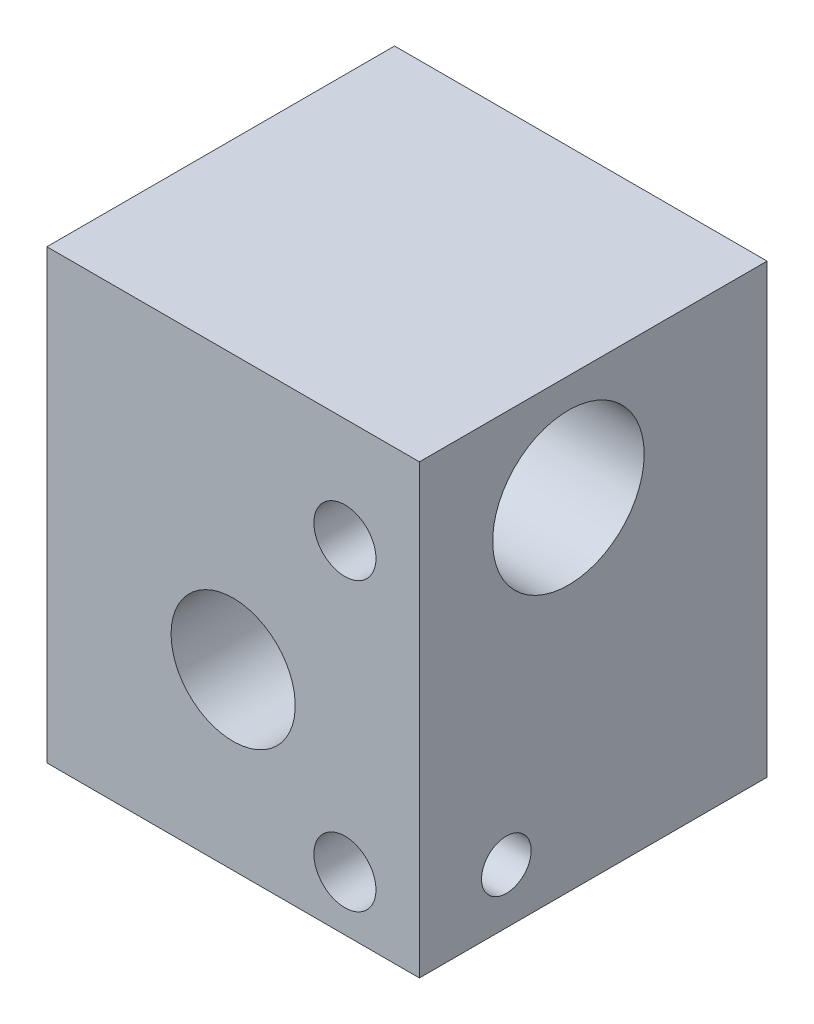
ISO-10303-21;
HEADER;
FILE_DESCRIPTION(('STEP AP214'),'2;1');
FILE_NAME('part.step','',(''),(''),'','','');
FILE_SCHEMA(('AUTOMOTIVE_DESIGN { 1 0 10303 214 1 1 1 1 }'));
ENDSEC;
DATA;
#1=APPLICATION_CONTEXT('core data for automotive mechanical design processes');
#2=APPLICATION_PROTOCOL_DEFINITION('international standard','automotive_design',2000,#1);
#3=PRODUCT_CONTEXT('',#1,'mechanical');
#4=PRODUCT('Part','Part','',(#3));
#5=PRODUCT_RELATED_PRODUCT_CATEGORY('part','',(#4));
#6=PRODUCT_DEFINITION_FORMATION('','',#4);
#7=PRODUCT_DEFINITION_CONTEXT('part definition',#1,'design');
#8=PRODUCT_DEFINITION('design','',#6,#7);
#9=PRODUCT_DEFINITION_SHAPE('','',#8);
#10=(LENGTH_UNIT() NAMED_UNIT(*) SI_UNIT(.MILLI.,.METRE.));
#11=(NAMED_UNIT(*) PLANE_ANGLE_UNIT() SI_UNIT($,.RADIAN.));
#12=(NAMED_UNIT(*) SI_UNIT($,.STERADIAN.) SOLID_ANGLE_UNIT());
#13=UNCERTAINTY_MEASURE_WITH_UNIT(LENGTH_MEASURE(1.E-05),#10,'distance_accuracy_value','');
#14=(GEOMETRIC_REPRESENTATION_CONTEXT(3) GLOBAL_UNCERTAINTY_ASSIGNED_CONTEXT((#13)) GLOBAL_UNIT_ASSIGNED_CONTEXT((#10,
#11,#12)) REPRESENTATION_CONTEXT('',''));
#15=CARTESIAN_POINT('',(0.,0.,0.));
#16=DIRECTION('',(0.,0.,1.));
#17=DIRECTION('',(1.,0.,0.));
#18=AXIS2_PLACEMENT_3D('',#15,#16,#17);
#19=CARTESIAN_POINT('',(7.5,-9.,14.));
#20=DIRECTION('',(-1.,0.,0.));
#21=DIRECTION('',(0.,0.,1.));
#22=AXIS2_PLACEMENT_3D('',#19,#20,#21);
#23=PLANE('',#22);
#24=CARTESIAN_POINT('',(7.5,-6.8,10.5));
#25=DIRECTION('',(1.,0.,0.));
#26=DIRECTION('',(0.,0.,-1.));
#27=AXIS2_PLACEMENT_3D('',#24,#25,#26);
#28=CIRCLE('',#27,0.999999999999998);
#29=CARTESIAN_POINT('',(7.5,-6.8,9.50000000000001));
#30=VERTEX_POINT('',#29);
#31=EDGE_CURVE('E109',#30,#30,#28,.T.);
#32=ORIENTED_EDGE('',*,*,#31,.F.);
#33=EDGE_LOOP('',(#32));
#34=FACE_BOUND('',#33,.T.);
#35=CARTESIAN_POINT('',(7.5,4.75,8.));
#36=DIRECTION('',(1.,0.,0.));
#37=DIRECTION('',(0.,0.,-1.));
#38=AXIS2_PLACEMENT_3D('',#35,#36,#37);
#39=CIRCLE('',#38,3.05);
#40=CARTESIAN_POINT('',(7.5,4.75,4.95));
#41=VERTEX_POINT('',#40);
#42=EDGE_CURVE('E234',#41,#41,#39,.T.);
#43=ORIENTED_EDGE('',*,*,#42,.F.);
#44=EDGE_LOOP('',(#43));
#45=FACE_BOUND('',#44,.T.);
#46=DIRECTION('',(0.,1.,0.));
#47=VECTOR('',#46,1.);
#48=CARTESIAN_POINT('',(7.5,-9.,0.));
#49=LINE('',#48,#47);
#50=CARTESIAN_POINT('',(7.5,-9.,0.));
#51=VERTEX_POINT('',#50);
#52=CARTESIAN_POINT('',(7.5,9.,0.));
#53=VERTEX_POINT('',#52);
#54=EDGE_CURVE('E195',#51,#53,#49,.T.);
#55=ORIENTED_EDGE('',*,*,#54,.T.);
#56=DIRECTION('',(0.,0.,-1.));
#57=VECTOR('',#56,1.);
#58=CARTESIAN_POINT('',(7.5,9.,14.));
#59=LINE('',#58,#57);
#60=CARTESIAN_POINT('',(7.5,9.,14.));
#61=VERTEX_POINT('',#60);
#62=EDGE_CURVE('E140',#61,#53,#59,.T.);
#63=ORIENTED_EDGE('',*,*,#62,.F.);
#64=DIRECTION('',(0.,1.,0.));
#65=VECTOR('',#64,1.);
#66=CARTESIAN_POINT('',(7.5,-9.,14.));
#67=LINE('',#66,#65);
#68=CARTESIAN_POINT('',(7.5,-9.,14.));
#69=VERTEX_POINT('',#68);
#70=EDGE_CURVE('E206',#69,#61,#67,.T.);
#71=ORIENTED_EDGE('',*,*,#70,.F.);
#72=DIRECTION('',(0.,0.,-1.));
#73=VECTOR('',#72,1.);
#74=CARTESIAN_POINT('',(7.5,-9.,14.));
#75=LINE('',#74,#73);
#76=EDGE_CURVE('E210',#69,#51,#75,.T.);
#77=ORIENTED_EDGE('',*,*,#76,.T.);
#78=EDGE_LOOP('',(#55,#63,#71,#77));
#79=FACE_BOUND('',#78,.T.);
#80=ADVANCED_FACE('F38',(#34,#45,#79),#23,.F.);
#81=CARTESIAN_POINT('',(-7.5,9.,14.));
#82=DIRECTION('',(0.,-1.,0.));
#83=DIRECTION('',(0.,0.,-1.));
#84=AXIS2_PLACEMENT_3D('',#81,#82,#83);
#85=PLANE('',#84);
#86=DIRECTION('',(-1.,0.,0.));
#87=VECTOR('',#86,1.);
#88=CARTESIAN_POINT('',(-7.5,9.,0.));
#89=LINE('',#88,#87);
#90=CARTESIAN_POINT('',(-7.5,9.,0.));
#91=VERTEX_POINT('',#90);
#92=EDGE_CURVE('E185',#53,#91,#89,.T.);
#93=ORIENTED_EDGE('',*,*,#92,.T.);
#94=DIRECTION('',(0.,0.,-1.));
#95=VECTOR('',#94,1.);
#96=CARTESIAN_POINT('',(-7.5,9.,14.));
#97=LINE('',#96,#95);
#98=CARTESIAN_POINT('',(-7.5,9.,14.));
#99=VERTEX_POINT('',#98);
#100=EDGE_CURVE('E187',#99,#91,#97,.T.);
#101=ORIENTED_EDGE('',*,*,#100,.F.);
#102=DIRECTION('',(-1.,0.,0.));
#103=VECTOR('',#102,1.);
#104=CARTESIAN_POINT('',(-7.5,9.,14.));
#105=LINE('',#104,#103);
#106=EDGE_CURVE('E220',#61,#99,#105,.T.);
#107=ORIENTED_EDGE('',*,*,#106,.F.);
#108=ORIENTED_EDGE('',*,*,#62,.T.);
#109=EDGE_LOOP('',(#93,#101,#107,#108));
#110=FACE_BOUND('',#109,.T.);
#111=ADVANCED_FACE('F175',(#110),#85,.F.);
#112=CARTESIAN_POINT('',(-7.5,-9.,14.));
#113=DIRECTION('',(1.,0.,0.));
#114=DIRECTION('',(0.,0.,-1.));
#115=AXIS2_PLACEMENT_3D('',#112,#113,#114);
#116=PLANE('',#115);
#117=CARTESIAN_POINT('',(-7.5,4.75,8.));
#118=DIRECTION('',(1.,0.,0.));
#119=DIRECTION('',(0.,0.,-1.));
#120=AXIS2_PLACEMENT_3D('',#117,#118,#119);
#121=CIRCLE('',#120,3.05);
#122=CARTESIAN_POINT('',(-7.5,4.75,4.95));
#123=VERTEX_POINT('',#122);
#124=EDGE_CURVE('E231',#123,#123,#121,.T.);
#125=ORIENTED_EDGE('',*,*,#124,.T.);
#126=EDGE_LOOP('',(#125));
#127=FACE_BOUND('',#126,.T.);
#128=DIRECTION('',(0.,-1.,0.));
#129=VECTOR('',#128,1.);
#130=CARTESIAN_POINT('',(-7.5,-9.,0.));
#131=LINE('',#130,#129);
#132=CARTESIAN_POINT('',(-7.5,-9.,0.));
#133=VERTEX_POINT('',#132);
#134=EDGE_CURVE('E194',#91,#133,#131,.T.);
#135=ORIENTED_EDGE('',*,*,#134,.T.);
#136=DIRECTION('',(0.,0.,-1.));
#137=VECTOR('',#136,1.);
#138=CARTESIAN_POINT('',(-7.5,-9.,14.));
#139=LINE('',#138,#137);
#140=CARTESIAN_POINT('',(-7.5,-9.,14.));
#141=VERTEX_POINT('',#140);
#142=EDGE_CURVE('E201',#141,#133,#139,.T.);
#143=ORIENTED_EDGE('',*,*,#142,.F.);
#144=DIRECTION('',(0.,-1.,0.));
#145=VECTOR('',#144,1.);
#146=CARTESIAN_POINT('',(-7.5,-9.,14.));
#147=LINE('',#146,#145);
#148=EDGE_CURVE('E200',#99,#141,#147,.T.);
#149=ORIENTED_EDGE('',*,*,#148,.F.);
#150=ORIENTED_EDGE('',*,*,#100,.T.);
#151=EDGE_LOOP('',(#135,#143,#149,#150));
#152=FACE_BOUND('',#151,.T.);
#153=ADVANCED_FACE('F172',(#127,#152),#116,.F.);
#154=CARTESIAN_POINT('',(-7.5,-9.,14.));
#155=DIRECTION('',(0.,1.,0.));
#156=DIRECTION('',(0.,0.,1.));
#157=AXIS2_PLACEMENT_3D('',#154,#155,#156);
#158=PLANE('',#157);
#159=DIRECTION('',(1.,0.,0.));
#160=VECTOR('',#159,1.);
#161=CARTESIAN_POINT('',(-7.5,-9.,0.));
#162=LINE('',#161,#160);
#163=EDGE_CURVE('E204',#133,#51,#162,.T.);
#164=ORIENTED_EDGE('',*,*,#163,.T.);
#165=ORIENTED_EDGE('',*,*,#76,.F.);
#166=DIRECTION('',(1.,0.,0.));
#167=VECTOR('',#166,1.);
#168=CARTESIAN_POINT('',(-7.5,-9.,14.));
#169=LINE('',#168,#167);
#170=EDGE_CURVE('E213',#141,#69,#169,.T.);
#171=ORIENTED_EDGE('',*,*,#170,.F.);
#172=ORIENTED_EDGE('',*,*,#142,.T.);
#173=EDGE_LOOP('',(#164,#165,#171,#172));
#174=FACE_BOUND('',#173,.T.);
#175=ADVANCED_FACE('F165',(#174),#158,.F.);
#176=CARTESIAN_POINT('',(0.,0.,14.));
#177=DIRECTION('',(0.,0.,-1.));
#178=DIRECTION('',(-1.,0.,0.));
#179=AXIS2_PLACEMENT_3D('',#176,#177,#178);
#180=PLANE('',#179);
#181=CARTESIAN_POINT('',(4.5,4.75,14.));
#182=DIRECTION('',(0.,0.,1.));
#183=DIRECTION('',(1.,0.,0.));
#184=AXIS2_PLACEMENT_3D('',#181,#182,#183);
#185=CIRCLE('',#184,1.24999999999999);
#186=CARTESIAN_POINT('',(5.74999999999999,4.75,14.));
#187=VERTEX_POINT('',#186);
#188=EDGE_CURVE('E246',#187,#187,#185,.T.);
#189=ORIENTED_EDGE('',*,*,#188,.F.);
#190=EDGE_LOOP('',(#189));
#191=FACE_BOUND('',#190,.T.);
#192=CARTESIAN_POINT('',(4.5,-6.8,14.));
#193=DIRECTION('',(0.,0.,1.));
#194=DIRECTION('',(1.,0.,0.));
#195=AXIS2_PLACEMENT_3D('',#192,#193,#194);
#196=CIRCLE('',#195,1.24999999999999);
#197=CARTESIAN_POINT('',(5.74999999999999,-6.8,14.));
#198=VERTEX_POINT('',#197);
#199=EDGE_CURVE('E244',#198,#198,#196,.T.);
#200=ORIENTED_EDGE('',*,*,#199,.F.);
#201=EDGE_LOOP('',(#200));
#202=FACE_BOUND('',#201,.T.);
#203=CARTESIAN_POINT('',(0.,-2.,14.));
#204=DIRECTION('',(0.,0.,-1.));
#205=DIRECTION('',(-1.,0.,0.));
#206=AXIS2_PLACEMENT_3D('',#203,#204,#205);
#207=CIRCLE('',#206,2.5);
#208=CARTESIAN_POINT('',(-2.5,-2.,14.));
#209=VERTEX_POINT('',#208);
#210=EDGE_CURVE('E223',#209,#209,#207,.T.);
#211=ORIENTED_EDGE('',*,*,#210,.T.);
#212=EDGE_LOOP('',(#211));
#213=FACE_BOUND('',#212,.T.);
#214=ORIENTED_EDGE('',*,*,#70,.T.);
#215=ORIENTED_EDGE('',*,*,#106,.T.);
#216=ORIENTED_EDGE('',*,*,#148,.T.);
#217=ORIENTED_EDGE('',*,*,#170,.T.);
#218=EDGE_LOOP('',(#214,#215,#216,#217));
#219=FACE_BOUND('',#218,.T.);
#220=ADVANCED_FACE('F162',(#191,#202,#213,#219),#180,.F.);
#221=CARTESIAN_POINT('',(0.,0.,0.));
#222=DIRECTION('',(0.,0.,-1.));
#223=DIRECTION('',(-1.,0.,0.));
#224=AXIS2_PLACEMENT_3D('',#221,#222,#223);
#225=PLANE('',#224);
#226=CARTESIAN_POINT('',(0.,-2.,0.));
#227=DIRECTION('',(0.,0.,-1.));
#228=DIRECTION('',(-1.,0.,0.));
#229=AXIS2_PLACEMENT_3D('',#226,#227,#228);
#230=CIRCLE('',#229,2.5);
#231=CARTESIAN_POINT('',(-2.5,-2.,0.));
#232=VERTEX_POINT('',#231);
#233=EDGE_CURVE('E226',#232,#232,#230,.T.);
#234=ORIENTED_EDGE('',*,*,#233,.F.);
#235=EDGE_LOOP('',(#234));
#236=FACE_BOUND('',#235,.T.);
#237=ORIENTED_EDGE('',*,*,#54,.F.);
#238=ORIENTED_EDGE('',*,*,#163,.F.);
#239=ORIENTED_EDGE('',*,*,#134,.F.);
#240=ORIENTED_EDGE('',*,*,#92,.F.);
#241=EDGE_LOOP('',(#237,#238,#239,#240));
#242=FACE_BOUND('',#241,.T.);
#243=ADVANCED_FACE('F160',(#236,#242),#225,.T.);
#244=CARTESIAN_POINT('',(0.,-2.,14.));
#245=DIRECTION('',(0.,0.,-1.));
#246=DIRECTION('',(-1.,0.,0.));
#247=AXIS2_PLACEMENT_3D('',#244,#245,#246);
#248=CYLINDRICAL_SURFACE('',#247,2.5);
#249=ORIENTED_EDGE('',*,*,#210,.F.);
#250=EDGE_LOOP('',(#249));
#251=FACE_BOUND('',#250,.T.);
#252=ORIENTED_EDGE('',*,*,#233,.T.);
#253=EDGE_LOOP('',(#252));
#254=FACE_BOUND('',#253,.T.);
#255=ADVANCED_FACE('F156',(#251,#254),#248,.F.);
#256=CARTESIAN_POINT('',(-7.5,4.75,8.));
#257=DIRECTION('',(1.,0.,0.));
#258=DIRECTION('',(0.,0.,-1.));
#259=AXIS2_PLACEMENT_3D('',#256,#257,#258);
#260=CYLINDRICAL_SURFACE('',#259,3.05);
#261=CARTESIAN_POINT('',(5.74999999999999,4.75,11.05));
#262=CARTESIAN_POINT('',(5.74999317358084,4.81705105449435,11.0499949013604));
#263=CARTESIAN_POINT('',(5.7445728904159,4.88421220939516,11.0477631660117));
#264=CARTESIAN_POINT('',(5.7230821427269,5.01663531512961,11.0390522074982));
#265=CARTESIAN_POINT('',(5.7069833965083,5.08189174087961,11.0325617055695));
#266=CARTESIAN_POINT('',(5.66482596800735,5.20837429284752,11.0160314903456));
#267=CARTESIAN_POINT('',(5.63880056530878,5.2696130929358,11.0060036445159));
#268=CARTESIAN_POINT('',(5.57766372514542,5.38679775394015,10.9833797920162));
#269=CARTESIAN_POINT('',(5.54255520538643,5.44274530666015,10.9707846103085));
#270=CARTESIAN_POINT('',(5.46243359833868,5.55058268229026,10.9436027218373));
#271=CARTESIAN_POINT('',(5.41704813784625,5.60217961883631,10.9289521872081));
#272=CARTESIAN_POINT('',(5.31844769395315,5.69727980579278,10.8995935820288));
#273=CARTESIAN_POINT('',(5.26522873562099,5.74077892161812,10.8848854859807));
#274=CARTESIAN_POINT('',(5.1494220879687,5.82047635819198,10.85630174305));
#275=CARTESIAN_POINT('',(5.08651058665788,5.85623272255294,10.8424982426337));
#276=CARTESIAN_POINT('',(4.95491722684178,5.91652509902148,10.8182942706523));
#277=CARTESIAN_POINT('',(4.88623826542879,5.9410667050528,10.8078921032399));
#278=CARTESIAN_POINT('',(4.74842884283273,5.977033698322,10.7923570793826));
#279=CARTESIAN_POINT('',(4.67947149284317,5.98902161527503,10.7869994326088));
#280=CARTESIAN_POINT('',(4.54033187566907,6.00129693566521,10.7815114553913));
#281=CARTESIAN_POINT('',(4.47015027248521,6.00159049579919,10.7813783743849));
#282=CARTESIAN_POINT('',(4.33607409840986,5.99089353762405,10.7861636899656));
#283=CARTESIAN_POINT('',(4.27209740726591,5.98073314256808,10.7907104791605));
#284=CARTESIAN_POINT('',(4.14685271703793,5.95080567936669,10.8037170132426));
#285=CARTESIAN_POINT('',(4.08558521945647,5.93103684064336,10.8121774793014));
#286=CARTESIAN_POINT('',(3.96597856734735,5.88207159424284,10.8322471574019));
#287=CARTESIAN_POINT('',(3.90772757534972,5.85268647565431,10.8439185833376));
#288=CARTESIAN_POINT('',(3.79676189319712,5.78545581744839,10.8690795378448));
#289=CARTESIAN_POINT('',(3.74404935655718,5.7476070046597,10.8825697690007));
#290=CARTESIAN_POINT('',(3.64113506271575,5.66089979031177,10.9111866936785));
#291=CARTESIAN_POINT('',(3.59148817119212,5.61139546177047,10.9263571479584));
#292=CARTESIAN_POINT('',(3.50101833818234,5.50460843164101,10.9556944852389));
#293=CARTESIAN_POINT('',(3.46019733238115,5.44732402821036,10.9698611476317));
#294=CARTESIAN_POINT('',(3.38776019476994,5.32496342854657,10.9959821432301));
#295=CARTESIAN_POINT('',(3.35636271935724,5.25974527572702,11.0078818781997));
#296=CARTESIAN_POINT('',(3.30517803112997,5.12434088842293,11.0277118513072));
#297=CARTESIAN_POINT('',(3.28538461664024,5.05415733016857,11.0356442094366));
#298=CARTESIAN_POINT('',(3.25911499785756,4.91545720041041,11.0462536382505));
#299=CARTESIAN_POINT('',(3.25189372784432,4.84710415103708,11.0492242691095));
#300=CARTESIAN_POINT('',(3.24876092149755,4.71010441371817,11.0505074612745));
#301=CARTESIAN_POINT('',(3.25284627086616,4.64145781182913,11.0488213052473));
#302=CARTESIAN_POINT('',(3.27167121733155,4.50926209998629,11.0411715650926));
#303=CARTESIAN_POINT('',(3.28589367478943,4.44562598291882,11.0354157047658));
#304=CARTESIAN_POINT('',(3.32387605471634,4.32170816248345,11.0204245132917));
#305=CARTESIAN_POINT('',(3.34763719121059,4.26142688721188,11.0111887392511));
#306=CARTESIAN_POINT('',(3.40479928404273,4.14383011012163,10.9897729532255));
#307=CARTESIAN_POINT('',(3.43847544195124,4.08666382302296,10.9775107773215));
#308=CARTESIAN_POINT('',(3.51420811639302,3.97859041874229,10.9513596558571));
#309=CARTESIAN_POINT('',(3.55626807827196,3.92768588879936,10.9374700424678));
#310=CARTESIAN_POINT('',(3.65098440399942,3.82987991098666,10.9083776173988));
#311=CARTESIAN_POINT('',(3.70417275944046,3.78349954211682,10.8931504614281));
#312=CARTESIAN_POINT('',(3.81783195761042,3.70018452435906,10.8639729574469));
#313=CARTESIAN_POINT('',(3.87830425548019,3.66325176747518,10.8500228655432));
#314=CARTESIAN_POINT('',(4.00591935720062,3.59955272757804,10.8249182430305));
#315=CARTESIAN_POINT('',(4.0731350035576,3.57291696039833,10.8138001745101));
#316=CARTESIAN_POINT('',(4.21169404128461,3.53156002386075,10.7961436278396));
#317=CARTESIAN_POINT('',(4.28303413036749,3.51682946022231,10.7896015393776));
#318=CARTESIAN_POINT('',(4.42205571719578,3.50061997017984,10.7823768658224));
#319=CARTESIAN_POINT('',(4.48961071540186,3.49823064874135,10.7812918903951));
#320=CARTESIAN_POINT('',(4.62411541510115,3.50435741732201,10.784041310068));
#321=CARTESIAN_POINT('',(4.69106520115461,3.51287195937366,10.7878750068888));
#322=CARTESIAN_POINT('',(4.8194595845332,3.53980857539514,10.7996672497341));
#323=CARTESIAN_POINT('',(4.88101694579431,3.55778270632242,10.8074387530386));
#324=CARTESIAN_POINT('',(5.00026093044538,3.60269826055876,10.8260903977768));
#325=CARTESIAN_POINT('',(5.0579464682445,3.62964218632339,10.8369714066019));
#326=CARTESIAN_POINT('',(5.17152052867124,3.69356546820026,10.8614124432364));
#327=CARTESIAN_POINT('',(5.22710231558399,3.73104304994741,10.8750926415299));
#328=CARTESIAN_POINT('',(5.33147333634056,3.81425954659736,10.9032425910236));
#329=CARTESIAN_POINT('',(5.38026033074679,3.8600011738197,10.9177126003541));
#330=CARTESIAN_POINT('',(5.47314082024466,3.96222488066987,10.9470198528145));
#331=CARTESIAN_POINT('',(5.51667265144533,4.0192324065468,10.961812751821));
#332=CARTESIAN_POINT('',(5.59357367951555,4.14029737005191,10.9890812629905));
#333=CARTESIAN_POINT('',(5.6269382146159,4.20435802331352,11.0015558111556));
#334=CARTESIAN_POINT('',(5.68180811191665,4.33663629870453,11.0225880646031));
#335=CARTESIAN_POINT('',(5.70351052450805,4.40476171520484,11.0312104073118));
#336=CARTESIAN_POINT('',(5.73495872650017,4.54399616753341,11.0438313485993));
#337=CARTESIAN_POINT('',(5.74474216568277,4.61509507070934,11.0478445044153));
#338=CARTESIAN_POINT('',(5.74946289651355,4.70760124338892,11.0497805301545));
#339=CARTESIAN_POINT('',(5.75000215885384,4.72879511590617,11.0500016124439));
#340=CARTESIAN_POINT('',(5.74999999999999,4.75,11.05));
#341=B_SPLINE_CURVE_WITH_KNOTS('',3,(#261,#262,#263,#264,#265,#266,#267,#268,#269,#270,#271,
#272,#273,#274,#275,#276,#277,#278,#279,#280,#281,#282,#283,#284,#285,#286,#287,#288,#289,#290,
#291,#292,#293,#294,#295,#296,#297,#298,#299,#300,#301,#302,#303,#304,#305,#306,#307,#308,#309,
#310,#311,#312,#313,#314,#315,#316,#317,#318,#319,#320,#321,#322,#323,#324,#325,#326,#327,#328,
#329,#330,#331,#332,#333,#334,#335,#336,#337,#338,#339,#340),.UNSPECIFIED.,.T.,.F.,(4,2,2,2,2,2,
2,2,2,2,2,2,2,2,2,2,2,2,2,2,2,2,2,2,2,2,2,2,2,2,2,2,2,2,2,2,2,2,2,4),(0.,0.201094311180327,
0.402723354574274,0.60368228554281,0.804576743863708,1.01444492091329,1.22441996030868,
1.44431409976959,1.66409843594336,1.87354721803841,2.08288573073389,2.27679448285735,
2.47073898070664,2.66874390795883,2.86682554265503,3.08105274490332,3.29532688370776,
3.51424468844056,3.73304538781654,3.93837132545348,4.14364071369572,4.33912550528581,
4.53463518488672,4.7361865564197,4.93782092740471,5.15341391236424,5.36905003881043,
5.58733616568886,5.80544987646513,6.00721727204662,6.20895602688514,6.40190297186301,
6.59490379169176,6.79928960640031,7.00374262427849,7.22240178249367,7.44116104698124,
7.65609749208749,7.87035321839583,7.93394925864703),.UNSPECIFIED.);
#342=CARTESIAN_POINT('',(5.74999999999999,4.75,11.05));
#343=VERTEX_POINT('',#342);
#344=EDGE_CURVE('E141',#343,#343,#341,.T.);
#345=ORIENTED_EDGE('',*,*,#344,.T.);
#346=EDGE_LOOP('',(#345));
#347=FACE_BOUND('',#346,.T.);
#348=ORIENTED_EDGE('',*,*,#124,.F.);
#349=EDGE_LOOP('',(#348));
#350=FACE_BOUND('',#349,.T.);
#351=ORIENTED_EDGE('',*,*,#42,.T.);
#352=EDGE_LOOP('',(#351));
#353=FACE_BOUND('',#352,.T.);
#354=ADVANCED_FACE('F150',(#347,#350,#353),#260,.F.);
#355=CARTESIAN_POINT('',(4.5,-6.8,10.));
#356=DIRECTION('',(0.,0.,1.));
#357=DIRECTION('',(1.,0.,0.));
#358=AXIS2_PLACEMENT_3D('',#355,#356,#357);
#359=CONICAL_SURFACE('',#358,1.25,1.02974425867665);
#360=CARTESIAN_POINT('',(4.5,-6.8,9.24892422621555));
#361=VERTEX_POINT('',#360);
#362=VERTEX_LOOP('',#361);
#363=FACE_BOUND('',#362,.T.);
#364=CARTESIAN_POINT('',(4.5,-6.8,10.));
#365=DIRECTION('',(0.,0.,1.));
#366=DIRECTION('',(1.,0.,0.));
#367=AXIS2_PLACEMENT_3D('',#364,#365,#366);
#368=CIRCLE('',#367,1.25);
#369=CARTESIAN_POINT('',(3.598612181134,-7.66602540378443,10.));
#370=VERTEX_POINT('',#369);
#371=CARTESIAN_POINT('',(5.40138781886869,-7.66602540378681,10.000000000002));
#372=VERTEX_POINT('',#371);
#373=EDGE_CURVE('E243',#370,#372,#368,.T.);
#374=ORIENTED_EDGE('',*,*,#373,.T.);
#375=CARTESIAN_POINT('',(5.49028641707355,-7.69312930754734,10.0502));
#376=CARTESIAN_POINT('',(5.4620540291597,-7.68516229364402,10.0343944640343));
#377=CARTESIAN_POINT('',(5.43397441822092,-7.67667040293627,10.0185644062554));
#378=CARTESIAN_POINT('',(5.37820933805071,-7.65846567832842,9.98679857880335));
#379=CARTESIAN_POINT('',(5.35052460000254,-7.64875084220867,9.97086267732073));
#380=CARTESIAN_POINT('',(5.29534164443274,-7.62780610981276,9.93865263805377));
#381=CARTESIAN_POINT('',(5.26785172041544,-7.6165565790724,9.92237691803523));
#382=CARTESIAN_POINT('',(5.21372068820973,-7.59240944996764,9.88967177107602));
#383=CARTESIAN_POINT('',(5.18707899740182,-7.5795130147024,9.87324246012329));
#384=CARTESIAN_POINT('',(5.13220243909833,-7.55021227801001,9.83836852135706));
#385=CARTESIAN_POINT('',(5.10410431543777,-7.53357989189848,9.8198971567474));
#386=CARTESIAN_POINT('',(5.050345171257,-7.49710879666876,9.78255861572175));
#387=CARTESIAN_POINT('',(5.02467984624535,-7.4772759250474,9.76369221334503));
#388=CARTESIAN_POINT('',(4.98483989175455,-7.43999201796968,9.73135380836442));
#389=CARTESIAN_POINT('',(4.96954941989287,-7.4236625107789,9.71799347162254));
#390=CARTESIAN_POINT('',(4.9421847888438,-7.38857975994309,9.6912618305678));
#391=CARTESIAN_POINT('',(4.93009685493829,-7.36983742938766,9.67789082979815));
#392=CARTESIAN_POINT('',(4.91016740799822,-7.329590146974,9.65140304199133));
#393=CARTESIAN_POINT('',(4.90238168548031,-7.3080531773224,9.63829162851512));
#394=CARTESIAN_POINT('',(4.89169708291768,-7.26309379111954,9.61331666161574));
#395=CARTESIAN_POINT('',(4.88881009238113,-7.23966693149489,9.60145620952708));
#396=CARTESIAN_POINT('',(4.88623771053257,-7.18102854252964,9.5746459349784));
#397=CARTESIAN_POINT('',(4.8886037228914,-7.14530002689939,9.56074189203022));
#398=CARTESIAN_POINT('',(4.89581292295022,-7.07266926803107,9.53712400838137));
#399=CARTESIAN_POINT('',(4.90066989969421,-7.035761575187,9.52743405299092));
#400=CARTESIAN_POINT('',(4.91006860539325,-6.95380542606474,9.51086100553405));
#401=CARTESIAN_POINT('',(4.91437678220478,-6.90853802728334,9.50485597158093));
#402=CARTESIAN_POINT('',(4.91847480674921,-6.81754799344687,9.49912238604378));
#403=CARTESIAN_POINT('',(4.91828328292789,-6.77182801826921,9.49936795774198));
#404=CARTESIAN_POINT('',(4.9134188134261,-6.67863261058293,9.50622854677725));
#405=CARTESIAN_POINT('',(4.90849830019974,-6.63120016203334,9.51319551359829));
#406=CARTESIAN_POINT('',(4.8974167784806,-6.53776947303588,9.53380349357298));
#407=CARTESIAN_POINT('',(4.89125185371858,-6.4917763035517,9.54746577626934));
#408=CARTESIAN_POINT('',(4.88715963497419,-6.42244524242513,9.57365031385066));
#409=CARTESIAN_POINT('',(4.88674774685179,-6.39841640858866,9.58380701297793));
#410=CARTESIAN_POINT('',(4.88976593975289,-6.35153496523309,9.60582909571334));
#411=CARTESIAN_POINT('',(4.89316735273017,-6.32867491195562,9.61768115280813));
#412=CARTESIAN_POINT('',(4.90481955461782,-6.28460383870021,9.642669092288));
#413=CARTESIAN_POINT('',(4.9131225726936,-6.26341340810177,9.65581751190305));
#414=CARTESIAN_POINT('',(4.93411194219539,-6.22351706477168,9.68253382279197));
#415=CARTESIAN_POINT('',(4.94682115498955,-6.20482482880032,9.69610355897556));
#416=CARTESIAN_POINT('',(4.98149614630583,-6.16232995685964,9.72903491275925));
#417=CARTESIAN_POINT('',(5.00508221426014,-6.13985006830771,9.74834355388398));
#418=CARTESIAN_POINT('',(5.0558137494365,-6.098684880619,9.78659230699454));
#419=CARTESIAN_POINT('',(5.08298397356536,-6.08002851866165,9.80552869364957));
#420=CARTESIAN_POINT('',(5.14072146790838,-6.0447977067922,9.84396632214519));
#421=CARTESIAN_POINT('',(5.17139042773862,-6.02837263772574,9.86344892060987));
#422=CARTESIAN_POINT('',(5.23412643971759,-5.99799989181846,9.90217002760718));
#423=CARTESIAN_POINT('',(5.26619554023356,-5.98405600718381,9.92140812147574));
#424=CARTESIAN_POINT('',(5.3300143351173,-5.95868810757523,9.95899211536545));
#425=CARTESIAN_POINT('',(5.36173093611331,-5.94718922450714,9.97734442596747));
#426=CARTESIAN_POINT('',(5.4256642289682,-5.92585951930255,10.0138744249624));
#427=CARTESIAN_POINT('',(5.45787881496915,-5.91602307251018,10.032052497566));
#428=CARTESIAN_POINT('',(5.49028641707356,-5.90687069245266,10.0502));
#429=B_SPLINE_CURVE_WITH_KNOTS('',3,(#375,#376,#377,#378,#379,#380,#381,#382,#383,#384,#385,
#386,#387,#388,#389,#390,#391,#392,#393,#394,#395,#396,#397,#398,#399,#400,#401,#402,#403,#404,
#405,#406,#407,#408,#409,#410,#411,#412,#413,#414,#415,#416,#417,#418,#419,#420,#421,#422,#423,
#424,#425,#426,#427,#428),.UNSPECIFIED.,.F.,.F.,(4,2,2,2,2,2,2,2,2,2,2,2,2,2,2,2,2,2,2,2,2,2,2,
2,2,2,4),(0.,0.0999728954722881,0.200111649914619,0.301678803220376,0.403174619034591,
0.515584481665859,0.627791585764162,0.705740491157831,0.783348470749535,0.861940559971277,
0.940723125374574,1.05531115599275,1.17054046158092,1.30757349647233,1.44403932453253,
1.58806182841254,1.73254485532535,1.81057795926005,1.88802832841069,1.96631925883886,
2.04502263303189,2.1580235273095,2.271850389424,2.39132944073084,2.51098956226302,
2.62616392516714,2.74094044998116),.UNSPECIFIED.);
#430=CARTESIAN_POINT('',(5.401387818866,-5.93397459621556,10.));
#431=VERTEX_POINT('',#430);
#432=EDGE_CURVE('E11',#372,#431,#429,.T.);
#433=ORIENTED_EDGE('',*,*,#432,.T.);
#434=CARTESIAN_POINT('',(3.59861218113131,-5.93397459621319,10.000000000002));
#435=VERTEX_POINT('',#434);
#436=EDGE_CURVE('E238',#431,#435,#368,.T.);
#437=ORIENTED_EDGE('',*,*,#436,.T.);
#438=CARTESIAN_POINT('',(3.50971358292644,-5.90687069245266,10.0502));
#439=CARTESIAN_POINT('',(3.53331315066843,-5.91352483721161,10.0369915361994));
#440=CARTESIAN_POINT('',(3.5567997123455,-5.92055093156863,10.0237650161817));
#441=CARTESIAN_POINT('',(3.60349741941001,-5.9354342598509,9.99724961432135));
#442=CARTESIAN_POINT('',(3.62670833949662,-5.943292127758,9.98396069239588));
#443=CARTESIAN_POINT('',(3.69717031261121,-5.96872321181212,9.94319816564678));
#444=CARTESIAN_POINT('',(3.7438358110887,-5.98776882275197,9.91561372999426));
#445=CARTESIAN_POINT('',(3.83471240297246,-6.03095640395233,9.85981688611285));
#446=CARTESIAN_POINT('',(3.87891676344681,-6.05511156272037,9.83160302516138));
#447=CARTESIAN_POINT('',(3.94083716089381,-6.09681482391589,9.78872178686289));
#448=CARTESIAN_POINT('',(3.96066329263914,-6.11154589536983,9.77440315102412));
#449=CARTESIAN_POINT('',(3.99813510882635,-6.14332035661841,9.74552415052808));
#450=CARTESIAN_POINT('',(4.01578567575378,-6.16035838166081,9.73096441352294));
#451=CARTESIAN_POINT('',(4.04652590778618,-6.19591099573206,9.70278607647913));
#452=CARTESIAN_POINT('',(4.05985910623184,-6.21421741426561,9.68917928098483));
#453=CARTESIAN_POINT('',(4.08226510274055,-6.2533626627292,9.66229859506211));
#454=CARTESIAN_POINT('',(4.09136422741643,-6.27418480156528,9.64902314678261));
#455=CARTESIAN_POINT('',(4.10464310673414,-6.31793974424823,9.62349687802884));
#456=CARTESIAN_POINT('',(4.10881781004169,-6.34087468940768,9.61124712162209));
#457=CARTESIAN_POINT('',(4.1130626560013,-6.38806657508964,9.58840380415463));
#458=CARTESIAN_POINT('',(4.11309881514464,-6.41233282411698,9.57782466777655));
#459=CARTESIAN_POINT('',(4.11081909538786,-6.4604609728452,9.55906713984957));
#460=CARTESIAN_POINT('',(4.10859993826291,-6.4842984232144,9.55080787372999));
#461=CARTESIAN_POINT('',(4.10335614543741,-6.53246306784324,9.5361231670742));
#462=CARTESIAN_POINT('',(4.1003306042383,-6.55679078406328,9.52969980500596));
#463=CARTESIAN_POINT('',(4.09451085196856,-6.60579562257215,9.51871894904033));
#464=CARTESIAN_POINT('',(4.09171580951763,-6.63047107603482,9.51415449234926));
#465=CARTESIAN_POINT('',(4.08702679450585,-6.68017771335,9.50688722680716));
#466=CARTESIAN_POINT('',(4.08513254220296,-6.70520878427464,9.50418383988055));
#467=CARTESIAN_POINT('',(4.08254750308201,-6.75738125016417,9.5005412204046));
#468=CARTESIAN_POINT('',(4.08195889631626,-6.7845387048598,9.49975135089749));
#469=CARTESIAN_POINT('',(4.08241996599581,-6.83881884917335,9.50038504756376));
#470=CARTESIAN_POINT('',(4.08347004507912,-6.8659415286078,9.50180915772903));
#471=CARTESIAN_POINT('',(4.08697842937304,-6.92002793067095,9.50685576578911));
#472=CARTESIAN_POINT('',(4.0894441853843,-6.94699004361228,9.51048990123162));
#473=CARTESIAN_POINT('',(4.09516019310819,-7.00043858924835,9.51991792137252));
#474=CARTESIAN_POINT('',(4.09841040229521,-7.02692504764497,9.52571168900543));
#475=CARTESIAN_POINT('',(4.10519576081253,-7.08368196745148,9.54056108147484));
#476=CARTESIAN_POINT('',(4.10868992530325,-7.1138587577752,9.54999633842318));
#477=CARTESIAN_POINT('',(4.11285630884388,-7.17325822177272,9.57174106146463));
#478=CARTESIAN_POINT('',(4.11354654398704,-7.20248578590848,9.58403163962699));
#479=CARTESIAN_POINT('',(4.1096980334543,-7.25174952014176,9.60755661353825));
#480=CARTESIAN_POINT('',(4.10650824550243,-7.27215350887781,9.61819452914818));
#481=CARTESIAN_POINT('',(4.09631900767153,-7.31145889668884,9.64039608881511));
#482=CARTESIAN_POINT('',(4.08932129327636,-7.33036097577356,9.65195930911316));
#483=CARTESIAN_POINT('',(4.07187333548008,-7.36609999506259,9.67538611754455));
#484=CARTESIAN_POINT('',(4.0614398330349,-7.38294641649121,9.6872479966086));
#485=CARTESIAN_POINT('',(4.03793043027709,-7.41469361637308,9.71098474345566));
#486=CARTESIAN_POINT('',(4.02484833016168,-7.42958969221195,9.72285957546288));
#487=CARTESIAN_POINT('',(3.98245149583498,-7.47213854501448,9.75863019433972));
#488=CARTESIAN_POINT('',(3.95030629956499,-7.49711016597754,9.78229754158439));
#489=CARTESIAN_POINT('',(3.88231649195083,-7.54225642438732,9.82909749644402));
#490=CARTESIAN_POINT('',(3.84644852850504,-7.56239778690941,9.8522254565256));
#491=CARTESIAN_POINT('',(3.76145323607754,-7.6047199090487,9.90510677052085));
#492=CARTESIAN_POINT('',(3.7116214589034,-7.62564542244421,9.93472675232658));
#493=CARTESIAN_POINT('',(3.636071292196,-7.65346919608147,9.97858123510041));
#494=CARTESIAN_POINT('',(3.61102171575906,-7.66207715135555,9.9929551794052));
#495=CARTESIAN_POINT('',(3.56059863176369,-7.67831041892385,10.0216255671264));
#496=CARTESIAN_POINT('',(3.53522548724744,-7.68593674144481,10.0359220754779));
#497=CARTESIAN_POINT('',(3.50971358292645,-7.69312930754734,10.0502));
#498=B_SPLINE_CURVE_WITH_KNOTS('',3,(#438,#439,#440,#441,#442,#443,#444,#445,#446,#447,#448,
#449,#450,#451,#452,#453,#454,#455,#456,#457,#458,#459,#460,#461,#462,#463,#464,#465,#466,#467,
#468,#469,#470,#471,#472,#473,#474,#475,#476,#477,#478,#479,#480,#481,#482,#483,#484,#485,#486,
#487,#488,#489,#490,#491,#492,#493,#494,#495,#496,#497),.UNSPECIFIED.,.F.,.F.,(4,2,2,2,2,2,2,2,
2,2,2,2,2,2,2,2,2,2,2,2,2,2,2,2,2,2,2,2,2,4),(0.,0.0835520453506488,0.167168239405998,
0.339378728614746,0.512039264477074,0.597570075986012,0.68290529897088,0.761806801456584,
0.840210929777042,0.918695413123632,0.997824323169108,1.07369719179067,1.14965562058719,
1.22532686000053,1.30097458419883,1.38236014465605,1.46376570533486,1.54560368850049,
1.62743723618381,1.72272259273379,1.81739473431565,1.88674994840292,1.95607357990291,
2.02506430849321,2.09421843665384,2.23466803413924,2.37605903144819,2.56062408985319,
2.6510237064757,2.74132953346724),.UNSPECIFIED.);
#499=EDGE_CURVE('E51',#435,#370,#498,.T.);
#500=ORIENTED_EDGE('',*,*,#499,.T.);
#501=EDGE_LOOP('',(#374,#433,#437,#500));
#502=FACE_BOUND('',#501,.T.);
#503=ADVANCED_FACE('F147',(#363,#502),#359,.F.);
#504=CARTESIAN_POINT('',(4.5,-6.8,14.));
#505=DIRECTION('',(0.,0.,1.));
#506=DIRECTION('',(1.,0.,0.));
#507=AXIS2_PLACEMENT_3D('',#504,#505,#506);
#508=CYLINDRICAL_SURFACE('',#507,1.24999999999999);
#509=ORIENTED_EDGE('',*,*,#373,.F.);
#510=CARTESIAN_POINT('',(3.59861218113401,-7.66602540378443,10.));
#511=CARTESIAN_POINT('',(3.6184739762057,-7.68675902626416,10.0359648769701));
#512=CARTESIAN_POINT('',(3.63792426677371,-7.70550837472696,10.07356604043));
#513=CARTESIAN_POINT('',(3.67420457060918,-7.73869615813151,10.1525408698623));
#514=CARTESIAN_POINT('',(3.69099237800154,-7.75306795614247,10.1939614345163));
#515=CARTESIAN_POINT('',(3.71662484017291,-7.774191046944,10.2714782402932));
#516=CARTESIAN_POINT('',(3.72638490183204,-7.78188898138144,10.3069978275495));
#517=CARTESIAN_POINT('',(3.74119250823732,-7.79337834014281,10.3794434233902));
#518=CARTESIAN_POINT('',(3.74626821333322,-7.7971931227873,10.4163596202761));
#519=CARTESIAN_POINT('',(3.75087623406768,-7.80066203387391,10.4910401318515));
#520=CARTESIAN_POINT('',(3.7503659702569,-7.80028420352463,10.5288087679199));
#521=CARTESIAN_POINT('',(3.74379868009988,-7.79532595045897,10.6036304255502));
#522=CARTESIAN_POINT('',(3.73772850144249,-7.79073556263663,10.6406815374542));
#523=CARTESIAN_POINT('',(3.71917407194171,-7.7762048970141,10.7215636967049));
#524=CARTESIAN_POINT('',(3.70551473903188,-7.7652582085766,10.7649328812159));
#525=CARTESIAN_POINT('',(3.67391866748519,-7.7383604281203,10.8484480250011));
#526=CARTESIAN_POINT('',(3.65597022712358,-7.72239560717476,10.8885847576922));
#527=CARTESIAN_POINT('',(3.60917119928421,-7.67771680229838,10.9831807102462));
#528=CARTESIAN_POINT('',(3.57907694975281,-7.64650740694967,11.035843108341));
#529=CARTESIAN_POINT('',(3.5183559128812,-7.57529354321466,11.1345250696951));
#530=CARTESIAN_POINT('',(3.48772853079731,-7.53527858397909,11.1805365999219));
#531=CARTESIAN_POINT('',(3.42850448445096,-7.44599465399416,11.2658675150778));
#532=CARTESIAN_POINT('',(3.39994062620079,-7.3966085923144,11.3050886996043));
#533=CARTESIAN_POINT('',(3.34824880857565,-7.28936992436963,11.3743906370445));
#534=CARTESIAN_POINT('',(3.32510309630992,-7.23154600583372,11.4045013386614));
#535=CARTESIAN_POINT('',(3.29321706824316,-7.1287352289244,11.4454787311362));
#536=CARTESIAN_POINT('',(3.28223911477027,-7.08565789198627,11.4594195955315));
#537=CARTESIAN_POINT('',(3.26482284837991,-6.99714123564449,11.4814320245459));
#538=CARTESIAN_POINT('',(3.25838106982787,-6.95170374795623,11.4895080700306));
#539=CARTESIAN_POINT('',(3.25055997532032,-6.85954328009455,11.4993043184985));
#540=CARTESIAN_POINT('',(3.24919867951823,-6.81281631522798,11.5010018976059));
#541=CARTESIAN_POINT('',(3.25171166139105,-6.71972350506321,11.4978600596492));
#542=CARTESIAN_POINT('',(3.25558637936792,-6.67335769046427,11.493020092836));
#543=CARTESIAN_POINT('',(3.26789644071195,-6.58478275906895,11.4775477076195));
#544=CARTESIAN_POINT('',(3.27608478095272,-6.54248278388334,11.467228789151));
#545=CARTESIAN_POINT('',(3.29626920480038,-6.46041183970799,11.4415575190609));
#546=CARTESIAN_POINT('',(3.30826626745011,-6.42064152413306,11.4262038732148));
#547=CARTESIAN_POINT('',(3.33662734477677,-6.3406161027575,11.3894302647519));
#548=CARTESIAN_POINT('',(3.3532975400543,-6.30067249548245,11.3675731815956));
#549=CARTESIAN_POINT('',(3.38933145605348,-6.22495505790292,11.3193541579962));
#550=CARTESIAN_POINT('',(3.40869664925647,-6.18918352689241,11.2929897530507));
#551=CARTESIAN_POINT('',(3.45329012101718,-6.11506815716582,11.2305320137827));
#552=CARTESIAN_POINT('',(3.47890562257894,-6.07770544720324,11.1935526776411));
#553=CARTESIAN_POINT('',(3.53087218655124,-6.00934523514016,11.1144933360025));
#554=CARTESIAN_POINT('',(3.55722412508302,-5.97835571614283,11.0724070370985));
#555=CARTESIAN_POINT('',(3.60622712533196,-5.92544257606388,10.9872727118008));
#556=CARTESIAN_POINT('',(3.62899882820422,-5.90295754665743,10.9446436718525));
#557=CARTESIAN_POINT('',(3.67109389715927,-5.8639261797273,10.8551592797693));
#558=CARTESIAN_POINT('',(3.69042463040289,-5.84736707594537,10.8083132882733));
#559=CARTESIAN_POINT('',(3.7174904197567,-5.82512107880842,10.7254845679125));
#560=CARTESIAN_POINT('',(3.72696373236152,-5.81765791883793,10.6905617106662));
#561=CARTESIAN_POINT('',(3.7413777054509,-5.8064822586224,10.6192414314301));
#562=CARTESIAN_POINT('',(3.74632904724294,-5.80276091774684,10.582847697442));
#563=CARTESIAN_POINT('',(3.75084288272906,-5.79936325574491,10.5093054357715));
#564=CARTESIAN_POINT('',(3.75037402404743,-5.79971046874484,10.4721537588219));
#565=CARTESIAN_POINT('',(3.74406332067189,-5.80447363749868,10.3985445241533));
#566=CARTESIAN_POINT('',(3.73821204583665,-5.80889673433741,10.3620882993477));
#567=CARTESIAN_POINT('',(3.72015556167346,-5.82301417908605,10.2819504740776));
#568=CARTESIAN_POINT('',(3.70672784794526,-5.8337496511886,10.2387401629788));
#569=CARTESIAN_POINT('',(3.67558075675762,-5.86018777468765,10.1555160847111));
#570=CARTESIAN_POINT('',(3.65785350214665,-5.8758995594923,10.1155083660048));
#571=CARTESIAN_POINT('',(3.63248719620555,-5.89999800647273,10.0638693545138));
#572=CARTESIAN_POINT('',(3.62583601244268,-5.90645176298937,10.050797896025));
#573=CARTESIAN_POINT('',(3.61235217206512,-5.91984613798792,10.0250912505629));
#574=CARTESIAN_POINT('',(3.6055204429112,-5.92678448884926,10.0124543967728));
#575=CARTESIAN_POINT('',(3.59861218113401,-5.93397459621556,10.));
#576=B_SPLINE_CURVE_WITH_KNOTS('',3,(#510,#511,#512,#513,#514,#515,#516,#517,#518,#519,#520,
#521,#522,#523,#524,#525,#526,#527,#528,#529,#530,#531,#532,#533,#534,#535,#536,#537,#538,#539,
#540,#541,#542,#543,#544,#545,#546,#547,#548,#549,#550,#551,#552,#553,#554,#555,#556,#557,#558,
#559,#560,#561,#562,#563,#564,#565,#566,#567,#568,#569,#570,#571,#572,#573,#574,#575),
.UNSPECIFIED.,.F.,.F.,(4,2,2,2,2,2,2,2,2,2,2,2,2,2,2,2,2,2,2,2,2,2,2,2,2,2,2,2,2,2,2,2,4),(0.,
0.138324485218999,0.278659992494997,0.391120375656935,0.50290020545926,0.615532674653407,
0.728432272744359,0.867958547262057,1.00786991882282,1.21146771466607,1.41530940067452,
1.62188934968772,1.82778264410881,1.96697817064107,2.1060672361662,2.24564917555029,
2.38524285325821,2.51759528452563,2.64998176494264,2.79491921961058,2.93993617777605,
3.1147433261769,3.28976812318017,3.44921515162318,3.60831658464993,3.71875479991453,
3.82893147021578,3.9397457590951,4.05075456820898,4.18950669098158,4.32851496646567,
4.37657658765978,4.42442669500541),.UNSPECIFIED.);
#577=EDGE_CURVE('E57',#370,#435,#576,.T.);
#578=ORIENTED_EDGE('',*,*,#577,.T.);
#579=ORIENTED_EDGE('',*,*,#436,.F.);
#580=CARTESIAN_POINT('',(5.40138781886599,-5.93397459621556,10.));
#581=CARTESIAN_POINT('',(5.3815260237943,-5.91324097373584,10.0359648769701));
#582=CARTESIAN_POINT('',(5.36207573322628,-5.89449162527303,10.07356604043));
#583=CARTESIAN_POINT('',(5.32579542939081,-5.86130384186849,10.1525408698623));
#584=CARTESIAN_POINT('',(5.30900762199845,-5.84693204385752,10.1939614345163));
#585=CARTESIAN_POINT('',(5.28337515982709,-5.825808953056,10.2714782402932));
#586=CARTESIAN_POINT('',(5.27361509816796,-5.81811101861856,10.3069978275495));
#587=CARTESIAN_POINT('',(5.25880749176268,-5.80662165985719,10.3794434233902));
#588=CARTESIAN_POINT('',(5.25373178666677,-5.80280687721269,10.4163596202761));
#589=CARTESIAN_POINT('',(5.24912376593232,-5.79933796612609,10.4910401318515));
#590=CARTESIAN_POINT('',(5.2496340297431,-5.79971579647536,10.5288087679199));
#591=CARTESIAN_POINT('',(5.25620131990012,-5.80467404954102,10.6036304255502));
#592=CARTESIAN_POINT('',(5.26227149855751,-5.80926443736337,10.6406815374542));
#593=CARTESIAN_POINT('',(5.28082592805829,-5.8237951029859,10.7215636967049));
#594=CARTESIAN_POINT('',(5.29448526096812,-5.83474179142339,10.7649328812159));
#595=CARTESIAN_POINT('',(5.32608133251481,-5.86163957187969,10.8484480250011));
#596=CARTESIAN_POINT('',(5.34402977287642,-5.87760439282524,10.8885847576922));
#597=CARTESIAN_POINT('',(5.39082880071578,-5.92228319770162,10.9831807102462));
#598=CARTESIAN_POINT('',(5.42092305024719,-5.95349259305033,11.035843108341));
#599=CARTESIAN_POINT('',(5.4816440871188,-6.02470645678533,11.1345250696951));
#600=CARTESIAN_POINT('',(5.51227146920269,-6.06472141602091,11.1805365999219));
#601=CARTESIAN_POINT('',(5.57149551554904,-6.15400534600584,11.2658675150778));
#602=CARTESIAN_POINT('',(5.6000593737992,-6.20339140768559,11.3050886996043));
#603=CARTESIAN_POINT('',(5.65175119142435,-6.31063007563036,11.3743906370445));
#604=CARTESIAN_POINT('',(5.67489690369008,-6.36845399416627,11.4045013386614));
#605=CARTESIAN_POINT('',(5.70678293175683,-6.47126477107559,11.4454787311362));
#606=CARTESIAN_POINT('',(5.71776088522973,-6.51434210801372,11.4594195955315));
#607=CARTESIAN_POINT('',(5.73517715162009,-6.6028587643555,11.4814320245459));
#608=CARTESIAN_POINT('',(5.74161893017213,-6.64829625204376,11.4895080700306));
#609=CARTESIAN_POINT('',(5.74944002467968,-6.74045671990545,11.4993043184985));
#610=CARTESIAN_POINT('',(5.75080132048177,-6.78718368477201,11.5010018976059));
#611=CARTESIAN_POINT('',(5.74828833860894,-6.88027649493679,11.4978600596492));
#612=CARTESIAN_POINT('',(5.74441362063208,-6.92664230953572,11.493020092836));
#613=CARTESIAN_POINT('',(5.73210355928805,-7.01521724093105,11.4775477076195));
#614=CARTESIAN_POINT('',(5.72391521904728,-7.05751721611666,11.467228789151));
#615=CARTESIAN_POINT('',(5.70373079519961,-7.139588160292,11.4415575190609));
#616=CARTESIAN_POINT('',(5.69173373254989,-7.17935847586693,11.4262038732148));
#617=CARTESIAN_POINT('',(5.66337265522323,-7.2593838972425,11.3894302647519));
#618=CARTESIAN_POINT('',(5.6467024599457,-7.29932750451754,11.3675731815956));
#619=CARTESIAN_POINT('',(5.61066854394652,-7.37504494209708,11.3193541579962));
#620=CARTESIAN_POINT('',(5.59130335074353,-7.41081647310758,11.2929897530507));
#621=CARTESIAN_POINT('',(5.54670987898282,-7.48493184283418,11.2305320137827));
#622=CARTESIAN_POINT('',(5.52109437742105,-7.52229455279676,11.1935526776411));
#623=CARTESIAN_POINT('',(5.46912781344876,-7.59065476485983,11.1144933360025));
#624=CARTESIAN_POINT('',(5.44277587491698,-7.62164428385717,11.0724070370985));
#625=CARTESIAN_POINT('',(5.39377287466804,-7.67455742393611,10.9872727118008));
#626=CARTESIAN_POINT('',(5.37100117179578,-7.69704245334256,10.9446436718525));
#627=CARTESIAN_POINT('',(5.32890610284073,-7.73607382027269,10.8551592797693));
#628=CARTESIAN_POINT('',(5.30957536959711,-7.75263292405463,10.8083132882733));
#629=CARTESIAN_POINT('',(5.2825095802433,-7.77487892119158,10.7254845679125));
#630=CARTESIAN_POINT('',(5.27303626763848,-7.78234208116207,10.6905617106662));
#631=CARTESIAN_POINT('',(5.25862229454909,-7.79351774137759,10.6192414314301));
#632=CARTESIAN_POINT('',(5.25367095275706,-7.79723908225315,10.582847697442));
#633=CARTESIAN_POINT('',(5.24915711727094,-7.80063674425509,10.5093054357715));
#634=CARTESIAN_POINT('',(5.24962597595257,-7.80028953125516,10.4721537588219));
#635=CARTESIAN_POINT('',(5.25593667932811,-7.79552636250132,10.3985445241533));
#636=CARTESIAN_POINT('',(5.26178795416334,-7.79110326566258,10.3620882993477));
#637=CARTESIAN_POINT('',(5.27984443832654,-7.77698582091394,10.2819504740776));
#638=CARTESIAN_POINT('',(5.29327215205474,-7.7662503488114,10.2387401629788));
#639=CARTESIAN_POINT('',(5.32441924324238,-7.73981222531235,10.1555160847111));
#640=CARTESIAN_POINT('',(5.34214649785335,-7.7241004405077,10.1155083660048));
#641=CARTESIAN_POINT('',(5.36751280379444,-7.70000199352727,10.0638693545138));
#642=CARTESIAN_POINT('',(5.37416398755732,-7.69354823701062,10.050797896025));
#643=CARTESIAN_POINT('',(5.38764782793488,-7.68015386201207,10.0250912505629));
#644=CARTESIAN_POINT('',(5.3944795570888,-7.67321551115073,10.0124543967728));
#645=CARTESIAN_POINT('',(5.40138781886599,-7.66602540378443,10.));
#646=B_SPLINE_CURVE_WITH_KNOTS('',3,(#580,#581,#582,#583,#584,#585,#586,#587,#588,#589,#590,
#591,#592,#593,#594,#595,#596,#597,#598,#599,#600,#601,#602,#603,#604,#605,#606,#607,#608,#609,
#610,#611,#612,#613,#614,#615,#616,#617,#618,#619,#620,#621,#622,#623,#624,#625,#626,#627,#628,
#629,#630,#631,#632,#633,#634,#635,#636,#637,#638,#639,#640,#641,#642,#643,#644,#645),
.UNSPECIFIED.,.F.,.F.,(4,2,2,2,2,2,2,2,2,2,2,2,2,2,2,2,2,2,2,2,2,2,2,2,2,2,2,2,2,2,2,2,4),(0.,
0.138324485218999,0.278659992494997,0.391120375656935,0.502900205459259,0.615532674653407,
0.728432272744358,0.867958547262056,1.00786991882282,1.21146771466607,1.41530940067452,
1.62188934968772,1.82778264410881,1.96697817064106,2.1060672361662,2.24564917555029,
2.38524285325821,2.51759528452563,2.64998176494264,2.79491921961058,2.93993617777604,
3.1147433261769,3.28976812318017,3.44921515162318,3.60831658464993,3.71875479991453,
3.82893147021578,3.9397457590951,4.05075456820898,4.18950669098158,4.32851496646567,
4.37657658765977,4.42442669500541),.UNSPECIFIED.);
#647=EDGE_CURVE('E64',#431,#372,#646,.T.);
#648=ORIENTED_EDGE('',*,*,#647,.T.);
#649=EDGE_LOOP('',(#509,#578,#579,#648));
#650=FACE_BOUND('',#649,.T.);
#651=ORIENTED_EDGE('',*,*,#199,.T.);
#652=EDGE_LOOP('',(#651));
#653=FACE_BOUND('',#652,.T.);
#654=ADVANCED_FACE('F125',(#650,#653),#508,.F.);
#655=CARTESIAN_POINT('',(4.5,4.75,14.));
#656=DIRECTION('',(0.,0.,1.));
#657=DIRECTION('',(1.,0.,0.));
#658=AXIS2_PLACEMENT_3D('',#655,#656,#657);
#659=CYLINDRICAL_SURFACE('',#658,1.24999999999999);
#660=ORIENTED_EDGE('',*,*,#188,.T.);
#661=EDGE_LOOP('',(#660));
#662=FACE_BOUND('',#661,.T.);
#663=ORIENTED_EDGE('',*,*,#344,.F.);
#664=EDGE_LOOP('',(#663));
#665=FACE_BOUND('',#664,.T.);
#666=ADVANCED_FACE('F103',(#662,#665),#659,.F.);
#667=CARTESIAN_POINT('',(-4.5,-6.8,10.5));
#668=DIRECTION('',(1.,0.,0.));
#669=DIRECTION('',(0.,0.,-1.));
#670=AXIS2_PLACEMENT_3D('',#667,#668,#669);
#671=CONICAL_SURFACE('',#670,0.999999999999997,1.02974425867665);
#672=CARTESIAN_POINT('',(-5.10086061902756,-6.8,10.5));
#673=VERTEX_POINT('',#672);
#674=VERTEX_LOOP('',#673);
#675=FACE_BOUND('',#674,.T.);
#676=CARTESIAN_POINT('',(-4.5,-6.8,10.5));
#677=DIRECTION('',(1.,0.,0.));
#678=DIRECTION('',(0.,0.,-1.));
#679=AXIS2_PLACEMENT_3D('',#676,#677,#678);
#680=CIRCLE('',#679,0.999999999999997);
#681=CARTESIAN_POINT('',(-4.5,-6.8,9.50000000000001));
#682=VERTEX_POINT('',#681);
#683=EDGE_CURVE('E107',#682,#682,#680,.T.);
#684=ORIENTED_EDGE('',*,*,#683,.T.);
#685=EDGE_LOOP('',(#684));
#686=FACE_BOUND('',#685,.T.);
#687=ADVANCED_FACE('F99',(#675,#686),#671,.F.);
#688=CARTESIAN_POINT('',(7.5,-6.8,10.5));
#689=DIRECTION('',(1.,0.,0.));
#690=DIRECTION('',(0.,0.,-1.));
#691=AXIS2_PLACEMENT_3D('',#688,#689,#690);
#692=CYLINDRICAL_SURFACE('',#691,0.999999999999997);
#693=ORIENTED_EDGE('',*,*,#683,.F.);
#694=EDGE_LOOP('',(#693));
#695=FACE_BOUND('',#694,.T.);
#696=ORIENTED_EDGE('',*,*,#499,.F.);
#697=ORIENTED_EDGE('',*,*,#577,.F.);
#698=EDGE_LOOP('',(#696,#697));
#699=FACE_BOUND('',#698,.T.);
#700=ADVANCED_FACE('F102',(#695,#699),#692,.F.);
#701=ORIENTED_EDGE('',*,*,#31,.T.);
#702=EDGE_LOOP('',(#701));
#703=FACE_BOUND('',#702,.T.);
#704=ORIENTED_EDGE('',*,*,#432,.F.);
#705=ORIENTED_EDGE('',*,*,#647,.F.);
#706=EDGE_LOOP('',(#704,#705));
#707=FACE_BOUND('',#706,.T.);
#708=ADVANCED_FACE('F128',(#703,#707),#692,.F.);
#709=CLOSED_SHELL('',(#80,#111,#153,#175,#220,#243,#255,#354,#503,#654,#666,#687,#700,#708));
#710=MANIFOLD_SOLID_BREP('B2',#709);
#711=ADVANCED_BREP_SHAPE_REPRESENTATION('',(#18,#710),#14);
#712=SHAPE_DEFINITION_REPRESENTATION(#9,#711);
ENDSEC;
END-ISO-10303-21;
